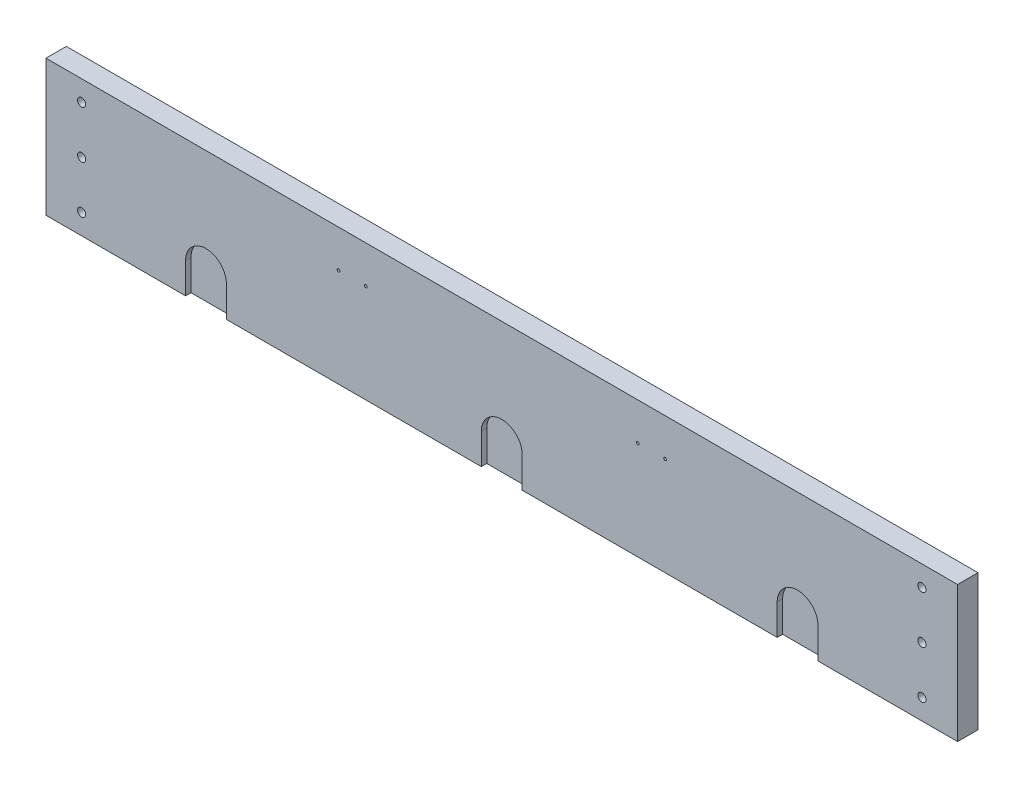
ISO-10303-21;
HEADER;
FILE_DESCRIPTION(('STEP AP214'),'2;1');
FILE_NAME('part.step','',(''),(''),'','','');
FILE_SCHEMA(('AUTOMOTIVE_DESIGN { 1 0 10303 214 1 1 1 1 }'));
ENDSEC;
DATA;
#1=APPLICATION_CONTEXT('core data for automotive mechanical design processes');
#2=APPLICATION_PROTOCOL_DEFINITION('international standard','automotive_design',2000,#1);
#3=PRODUCT_CONTEXT('',#1,'mechanical');
#4=PRODUCT('Part','Part','',(#3));
#5=PRODUCT_RELATED_PRODUCT_CATEGORY('part','',(#4));
#6=PRODUCT_DEFINITION_FORMATION('','',#4);
#7=PRODUCT_DEFINITION_CONTEXT('part definition',#1,'design');
#8=PRODUCT_DEFINITION('design','',#6,#7);
#9=PRODUCT_DEFINITION_SHAPE('','',#8);
#10=(LENGTH_UNIT() NAMED_UNIT(*) SI_UNIT(.MILLI.,.METRE.));
#11=(NAMED_UNIT(*) PLANE_ANGLE_UNIT() SI_UNIT($,.RADIAN.));
#12=(NAMED_UNIT(*) SI_UNIT($,.STERADIAN.) SOLID_ANGLE_UNIT());
#13=UNCERTAINTY_MEASURE_WITH_UNIT(LENGTH_MEASURE(1.E-05),#10,'distance_accuracy_value','');
#14=(GEOMETRIC_REPRESENTATION_CONTEXT(3) GLOBAL_UNCERTAINTY_ASSIGNED_CONTEXT((#13)) GLOBAL_UNIT_ASSIGNED_CONTEXT((#10,
#11,#12)) REPRESENTATION_CONTEXT('',''));
#15=CARTESIAN_POINT('',(0.,0.,0.));
#16=DIRECTION('',(0.,0.,1.));
#17=DIRECTION('',(1.,0.,0.));
#18=AXIS2_PLACEMENT_3D('',#15,#16,#17);
#19=CARTESIAN_POINT('',(0.,127.,0.));
#20=DIRECTION('',(0.,0.,-1.));
#21=DIRECTION('',(-1.,0.,0.));
#22=AXIS2_PLACEMENT_3D('',#19,#20,#21);
#23=PLANE('',#22);
#24=CARTESIAN_POINT('',(533.4,91.9479999999999,1.07552855510562E-13));
#25=DIRECTION('',(0.,0.,1.));
#26=DIRECTION('',(1.,0.,0.));
#27=AXIS2_PLACEMENT_3D('',#24,#25,#26);
#28=CIRCLE('',#27,1.26999999999991);
#29=CARTESIAN_POINT('',(534.67,91.9479999999999,1.07552855510562E-13));
#30=VERTEX_POINT('',#29);
#31=EDGE_CURVE('E381',#30,#30,#28,.F.);
#32=ORIENTED_EDGE('',*,*,#31,.F.);
#33=EDGE_LOOP('',(#32));
#34=FACE_BOUND('',#33,.T.);
#35=CARTESIAN_POINT('',(558.8,91.9479999999999,1.07552855510562E-13));
#36=DIRECTION('',(0.,0.,1.));
#37=DIRECTION('',(1.,0.,0.));
#38=AXIS2_PLACEMENT_3D('',#35,#36,#37);
#39=CIRCLE('',#38,1.27000000000003);
#40=CARTESIAN_POINT('',(560.07,91.9479999999999,1.07552855510562E-13));
#41=VERTEX_POINT('',#40);
#42=EDGE_CURVE('E384',#41,#41,#39,.F.);
#43=ORIENTED_EDGE('',*,*,#42,.F.);
#44=EDGE_LOOP('',(#43));
#45=FACE_BOUND('',#44,.T.);
#46=DIRECTION('',(0.,-1.,0.));
#47=VECTOR('',#46,1.);
#48=CARTESIAN_POINT('',(831.85,127.,0.));
#49=LINE('',#48,#47);
#50=CARTESIAN_POINT('',(831.85,127.,0.));
#51=VERTEX_POINT('',#50);
#52=CARTESIAN_POINT('',(831.85,0.,0.));
#53=VERTEX_POINT('',#52);
#54=EDGE_CURVE('E270',#51,#53,#49,.T.);
#55=ORIENTED_EDGE('',*,*,#54,.T.);
#56=DIRECTION('',(1.,0.,0.));
#57=VECTOR('',#56,1.);
#58=CARTESIAN_POINT('',(0.,0.,0.));
#59=LINE('',#58,#57);
#60=CARTESIAN_POINT('',(-19.05,0.,0.));
#61=VERTEX_POINT('',#60);
#62=EDGE_CURVE('E255',#61,#53,#59,.T.);
#63=ORIENTED_EDGE('',*,*,#62,.F.);
#64=DIRECTION('',(0.,-1.,0.));
#65=VECTOR('',#64,1.);
#66=CARTESIAN_POINT('',(-19.05,127.,0.));
#67=LINE('',#66,#65);
#68=CARTESIAN_POINT('',(-19.05,127.,0.));
#69=VERTEX_POINT('',#68);
#70=EDGE_CURVE('E11',#69,#61,#67,.T.);
#71=ORIENTED_EDGE('',*,*,#70,.F.);
#72=DIRECTION('',(1.,0.,0.));
#73=VECTOR('',#72,1.);
#74=CARTESIAN_POINT('',(0.,127.,0.));
#75=LINE('',#74,#73);
#76=EDGE_CURVE('E258',#69,#51,#75,.T.);
#77=ORIENTED_EDGE('',*,*,#76,.T.);
#78=EDGE_LOOP('',(#55,#63,#71,#77));
#79=FACE_BOUND('',#78,.T.);
#80=CARTESIAN_POINT('',(14.224,63.5,0.));
#81=DIRECTION('',(0.,0.,-1.));
#82=DIRECTION('',(-1.,0.,0.));
#83=AXIS2_PLACEMENT_3D('',#80,#81,#82);
#84=CIRCLE('',#83,3.80999999999999);
#85=CARTESIAN_POINT('',(10.414,63.5,0.));
#86=VERTEX_POINT('',#85);
#87=EDGE_CURVE('E228',#86,#86,#84,.F.);
#88=ORIENTED_EDGE('',*,*,#87,.T.);
#89=EDGE_LOOP('',(#88));
#90=FACE_BOUND('',#89,.T.);
#91=CARTESIAN_POINT('',(14.224,19.05,0.));
#92=DIRECTION('',(0.,0.,-1.));
#93=DIRECTION('',(-1.,0.,0.));
#94=AXIS2_PLACEMENT_3D('',#91,#92,#93);
#95=CIRCLE('',#94,3.80999999999999);
#96=CARTESIAN_POINT('',(10.414,19.05,0.));
#97=VERTEX_POINT('',#96);
#98=EDGE_CURVE('E235',#97,#97,#95,.F.);
#99=ORIENTED_EDGE('',*,*,#98,.T.);
#100=EDGE_LOOP('',(#99));
#101=FACE_BOUND('',#100,.T.);
#102=CARTESIAN_POINT('',(14.224,107.95,0.));
#103=DIRECTION('',(0.,0.,-1.));
#104=DIRECTION('',(-1.,0.,0.));
#105=AXIS2_PLACEMENT_3D('',#102,#103,#104);
#106=CIRCLE('',#105,3.80999999999999);
#107=CARTESIAN_POINT('',(10.414,107.95,0.));
#108=VERTEX_POINT('',#107);
#109=EDGE_CURVE('E231',#108,#108,#106,.F.);
#110=ORIENTED_EDGE('',*,*,#109,.T.);
#111=EDGE_LOOP('',(#110));
#112=FACE_BOUND('',#111,.T.);
#113=CARTESIAN_POINT('',(798.576,63.5,0.));
#114=DIRECTION('',(0.,0.,-1.));
#115=DIRECTION('',(-1.,0.,0.));
#116=AXIS2_PLACEMENT_3D('',#113,#114,#115);
#117=CIRCLE('',#116,3.80999999999999);
#118=CARTESIAN_POINT('',(794.766,63.5,0.));
#119=VERTEX_POINT('',#118);
#120=EDGE_CURVE('E222',#119,#119,#117,.T.);
#121=ORIENTED_EDGE('',*,*,#120,.F.);
#122=EDGE_LOOP('',(#121));
#123=FACE_BOUND('',#122,.T.);
#124=CARTESIAN_POINT('',(798.576,107.95,0.));
#125=DIRECTION('',(0.,0.,-1.));
#126=DIRECTION('',(-1.,0.,0.));
#127=AXIS2_PLACEMENT_3D('',#124,#125,#126);
#128=CIRCLE('',#127,3.80999999999999);
#129=CARTESIAN_POINT('',(794.766,107.95,0.));
#130=VERTEX_POINT('',#129);
#131=EDGE_CURVE('E247',#130,#130,#128,.T.);
#132=ORIENTED_EDGE('',*,*,#131,.F.);
#133=EDGE_LOOP('',(#132));
#134=FACE_BOUND('',#133,.T.);
#135=CARTESIAN_POINT('',(798.576,19.05,0.));
#136=DIRECTION('',(0.,0.,-1.));
#137=DIRECTION('',(-1.,0.,0.));
#138=AXIS2_PLACEMENT_3D('',#135,#136,#137);
#139=CIRCLE('',#138,3.80999999999999);
#140=CARTESIAN_POINT('',(794.766,19.05,0.));
#141=VERTEX_POINT('',#140);
#142=EDGE_CURVE('E241',#141,#141,#139,.T.);
#143=ORIENTED_EDGE('',*,*,#142,.F.);
#144=EDGE_LOOP('',(#143));
#145=FACE_BOUND('',#144,.T.);
#146=CARTESIAN_POINT('',(279.4,91.9479999999999,1.07552855510562E-13));
#147=DIRECTION('',(0.,0.,1.));
#148=DIRECTION('',(1.,0.,0.));
#149=AXIS2_PLACEMENT_3D('',#146,#147,#148);
#150=CIRCLE('',#149,1.26999999999998);
#151=CARTESIAN_POINT('',(280.67,91.9479999999999,1.07552855510562E-13));
#152=VERTEX_POINT('',#151);
#153=EDGE_CURVE('E401',#152,#152,#150,.T.);
#154=ORIENTED_EDGE('',*,*,#153,.T.);
#155=EDGE_LOOP('',(#154));
#156=FACE_BOUND('',#155,.T.);
#157=CARTESIAN_POINT('',(254.,91.9479999999999,1.07552855510562E-13));
#158=DIRECTION('',(0.,0.,1.));
#159=DIRECTION('',(1.,0.,0.));
#160=AXIS2_PLACEMENT_3D('',#157,#158,#159);
#161=CIRCLE('',#160,1.26999999999998);
#162=CARTESIAN_POINT('',(255.27,91.9479999999999,1.07552855510562E-13));
#163=VERTEX_POINT('',#162);
#164=EDGE_CURVE('E394',#163,#163,#161,.T.);
#165=ORIENTED_EDGE('',*,*,#164,.T.);
#166=EDGE_LOOP('',(#165));
#167=FACE_BOUND('',#166,.T.);
#168=ADVANCED_FACE('F40',(#34,#45,#79,#90,#101,#112,#123,#134,#145,#156,#167),#23,.T.);
#169=CARTESIAN_POINT('',(0.,127.,19.0500000000001));
#170=DIRECTION('',(0.,0.,1.));
#171=DIRECTION('',(1.,0.,0.));
#172=AXIS2_PLACEMENT_3D('',#169,#170,#171);
#173=PLANE('',#172);
#174=CARTESIAN_POINT('',(533.4,91.9479999999999,19.0500000000001));
#175=DIRECTION('',(0.,0.,1.));
#176=DIRECTION('',(1.,0.,0.));
#177=AXIS2_PLACEMENT_3D('',#174,#175,#176);
#178=CIRCLE('',#177,1.26999999999991);
#179=CARTESIAN_POINT('',(534.67,91.9479999999999,19.0500000000001));
#180=VERTEX_POINT('',#179);
#181=EDGE_CURVE('E386',#180,#180,#178,.F.);
#182=ORIENTED_EDGE('',*,*,#181,.T.);
#183=EDGE_LOOP('',(#182));
#184=FACE_BOUND('',#183,.T.);
#185=CARTESIAN_POINT('',(558.8,91.9479999999999,19.0500000000001));
#186=DIRECTION('',(0.,0.,1.));
#187=DIRECTION('',(1.,0.,0.));
#188=AXIS2_PLACEMENT_3D('',#185,#186,#187);
#189=CIRCLE('',#188,1.27000000000003);
#190=CARTESIAN_POINT('',(560.07,91.9479999999999,19.0500000000001));
#191=VERTEX_POINT('',#190);
#192=EDGE_CURVE('E387',#191,#191,#189,.F.);
#193=ORIENTED_EDGE('',*,*,#192,.T.);
#194=EDGE_LOOP('',(#193));
#195=FACE_BOUND('',#194,.T.);
#196=CARTESIAN_POINT('',(14.224,63.5,19.05));
#197=DIRECTION('',(0.,0.,-1.));
#198=DIRECTION('',(-1.,0.,0.));
#199=AXIS2_PLACEMENT_3D('',#196,#197,#198);
#200=CIRCLE('',#199,3.80999999999999);
#201=CARTESIAN_POINT('',(10.414,63.5,19.05));
#202=VERTEX_POINT('',#201);
#203=EDGE_CURVE('E232',#202,#202,#200,.F.);
#204=ORIENTED_EDGE('',*,*,#203,.F.);
#205=EDGE_LOOP('',(#204));
#206=FACE_BOUND('',#205,.T.);
#207=CARTESIAN_POINT('',(14.224,19.05,19.05));
#208=DIRECTION('',(0.,0.,-1.));
#209=DIRECTION('',(-1.,0.,0.));
#210=AXIS2_PLACEMENT_3D('',#207,#208,#209);
#211=CIRCLE('',#210,3.80999999999999);
#212=CARTESIAN_POINT('',(10.414,19.05,19.05));
#213=VERTEX_POINT('',#212);
#214=EDGE_CURVE('E238',#213,#213,#211,.F.);
#215=ORIENTED_EDGE('',*,*,#214,.F.);
#216=EDGE_LOOP('',(#215));
#217=FACE_BOUND('',#216,.T.);
#218=CARTESIAN_POINT('',(14.224,107.95,19.05));
#219=DIRECTION('',(0.,0.,-1.));
#220=DIRECTION('',(-1.,0.,0.));
#221=AXIS2_PLACEMENT_3D('',#218,#219,#220);
#222=CIRCLE('',#221,3.80999999999999);
#223=CARTESIAN_POINT('',(10.414,107.95,19.05));
#224=VERTEX_POINT('',#223);
#225=EDGE_CURVE('E252',#224,#224,#222,.F.);
#226=ORIENTED_EDGE('',*,*,#225,.F.);
#227=EDGE_LOOP('',(#226));
#228=FACE_BOUND('',#227,.T.);
#229=CARTESIAN_POINT('',(798.576,63.5,19.05));
#230=DIRECTION('',(0.,0.,-1.));
#231=DIRECTION('',(-1.,0.,0.));
#232=AXIS2_PLACEMENT_3D('',#229,#230,#231);
#233=CIRCLE('',#232,3.80999999999999);
#234=CARTESIAN_POINT('',(794.766,63.5,19.05));
#235=VERTEX_POINT('',#234);
#236=EDGE_CURVE('E185',#235,#235,#233,.T.);
#237=ORIENTED_EDGE('',*,*,#236,.T.);
#238=EDGE_LOOP('',(#237));
#239=FACE_BOUND('',#238,.T.);
#240=CARTESIAN_POINT('',(798.576,107.95,19.05));
#241=DIRECTION('',(0.,0.,-1.));
#242=DIRECTION('',(-1.,0.,0.));
#243=AXIS2_PLACEMENT_3D('',#240,#241,#242);
#244=CIRCLE('',#243,3.80999999999999);
#245=CARTESIAN_POINT('',(794.766,107.95,19.05));
#246=VERTEX_POINT('',#245);
#247=EDGE_CURVE('E225',#246,#246,#244,.T.);
#248=ORIENTED_EDGE('',*,*,#247,.T.);
#249=EDGE_LOOP('',(#248));
#250=FACE_BOUND('',#249,.T.);
#251=CARTESIAN_POINT('',(798.576,19.05,19.05));
#252=DIRECTION('',(0.,0.,-1.));
#253=DIRECTION('',(-1.,0.,0.));
#254=AXIS2_PLACEMENT_3D('',#251,#252,#253);
#255=CIRCLE('',#254,3.80999999999999);
#256=CARTESIAN_POINT('',(794.766,19.05,19.05));
#257=VERTEX_POINT('',#256);
#258=EDGE_CURVE('E244',#257,#257,#255,.T.);
#259=ORIENTED_EDGE('',*,*,#258,.T.);
#260=EDGE_LOOP('',(#259));
#261=FACE_BOUND('',#260,.T.);
#262=DIRECTION('',(-1.,0.,0.));
#263=VECTOR('',#262,1.);
#264=CARTESIAN_POINT('',(0.,0.,19.0500000000001));
#265=LINE('',#264,#263);
#266=CARTESIAN_POINT('',(663.448,0.,19.05));
#267=VERTEX_POINT('',#266);
#268=CARTESIAN_POINT('',(425.45,0.,19.05));
#269=VERTEX_POINT('',#268);
#270=EDGE_CURVE('E173',#267,#269,#265,.T.);
#271=ORIENTED_EDGE('',*,*,#270,.F.);
#272=DIRECTION('',(0.,-1.,0.));
#273=VECTOR('',#272,1.);
#274=CARTESIAN_POINT('',(663.448,0.,19.05));
#275=LINE('',#274,#273);
#276=CARTESIAN_POINT('',(663.448,28.702,19.05));
#277=VERTEX_POINT('',#276);
#278=EDGE_CURVE('E154',#277,#267,#275,.T.);
#279=ORIENTED_EDGE('',*,*,#278,.F.);
#280=CARTESIAN_POINT('',(682.498,28.702,19.05));
#281=DIRECTION('',(0.,0.,-1.));
#282=DIRECTION('',(-1.,0.,0.));
#283=AXIS2_PLACEMENT_3D('',#280,#281,#282);
#284=CIRCLE('',#283,19.05);
#285=CARTESIAN_POINT('',(701.548,28.702,19.05));
#286=VERTEX_POINT('',#285);
#287=EDGE_CURVE('E162',#277,#286,#284,.T.);
#288=ORIENTED_EDGE('',*,*,#287,.T.);
#289=DIRECTION('',(0.,-1.,0.));
#290=VECTOR('',#289,1.);
#291=CARTESIAN_POINT('',(701.548,0.,19.05));
#292=LINE('',#291,#290);
#293=CARTESIAN_POINT('',(701.548,0.,19.05));
#294=VERTEX_POINT('',#293);
#295=EDGE_CURVE('E159',#286,#294,#292,.T.);
#296=ORIENTED_EDGE('',*,*,#295,.T.);
#297=CARTESIAN_POINT('',(831.85,0.,19.05));
#298=VERTEX_POINT('',#297);
#299=EDGE_CURVE('E276',#298,#294,#265,.T.);
#300=ORIENTED_EDGE('',*,*,#299,.F.);
#301=DIRECTION('',(0.,-1.,0.));
#302=VECTOR('',#301,1.);
#303=CARTESIAN_POINT('',(831.85,127.,19.05));
#304=LINE('',#303,#302);
#305=CARTESIAN_POINT('',(831.85,127.,19.05));
#306=VERTEX_POINT('',#305);
#307=EDGE_CURVE('E283',#306,#298,#304,.T.);
#308=ORIENTED_EDGE('',*,*,#307,.F.);
#309=DIRECTION('',(-1.,0.,0.));
#310=VECTOR('',#309,1.);
#311=CARTESIAN_POINT('',(0.,127.,19.0500000000001));
#312=LINE('',#311,#310);
#313=CARTESIAN_POINT('',(-19.05,127.,19.0500000000001));
#314=VERTEX_POINT('',#313);
#315=EDGE_CURVE('E264',#306,#314,#312,.T.);
#316=ORIENTED_EDGE('',*,*,#315,.T.);
#317=DIRECTION('',(0.,-1.,0.));
#318=VECTOR('',#317,1.);
#319=CARTESIAN_POINT('',(-19.05,127.,19.0500000000001));
#320=LINE('',#319,#318);
#321=CARTESIAN_POINT('',(-19.05,0.,19.0500000000001));
#322=VERTEX_POINT('',#321);
#323=EDGE_CURVE('E47',#314,#322,#320,.T.);
#324=ORIENTED_EDGE('',*,*,#323,.T.);
#325=CARTESIAN_POINT('',(111.252,0.,19.05));
#326=VERTEX_POINT('',#325);
#327=EDGE_CURVE('E275',#326,#322,#265,.T.);
#328=ORIENTED_EDGE('',*,*,#327,.F.);
#329=DIRECTION('',(0.,-1.,0.));
#330=VECTOR('',#329,1.);
#331=CARTESIAN_POINT('',(111.252,0.,19.05));
#332=LINE('',#331,#330);
#333=CARTESIAN_POINT('',(111.252,28.702,19.05));
#334=VERTEX_POINT('',#333);
#335=EDGE_CURVE('E204',#334,#326,#332,.T.);
#336=ORIENTED_EDGE('',*,*,#335,.F.);
#337=CARTESIAN_POINT('',(130.302,28.702,19.05));
#338=DIRECTION('',(0.,0.,-1.));
#339=DIRECTION('',(-1.,0.,0.));
#340=AXIS2_PLACEMENT_3D('',#337,#338,#339);
#341=CIRCLE('',#340,19.05);
#342=CARTESIAN_POINT('',(149.352,28.702,19.05));
#343=VERTEX_POINT('',#342);
#344=EDGE_CURVE('E206',#334,#343,#341,.T.);
#345=ORIENTED_EDGE('',*,*,#344,.T.);
#346=DIRECTION('',(0.,-1.,0.));
#347=VECTOR('',#346,1.);
#348=CARTESIAN_POINT('',(149.352,0.,19.05));
#349=LINE('',#348,#347);
#350=CARTESIAN_POINT('',(149.352,0.,19.05));
#351=VERTEX_POINT('',#350);
#352=EDGE_CURVE('E209',#343,#351,#349,.T.);
#353=ORIENTED_EDGE('',*,*,#352,.T.);
#354=CARTESIAN_POINT('',(387.35,0.,19.05));
#355=VERTEX_POINT('',#354);
#356=EDGE_CURVE('E350',#355,#351,#265,.T.);
#357=ORIENTED_EDGE('',*,*,#356,.F.);
#358=DIRECTION('',(0.,-1.,0.));
#359=VECTOR('',#358,1.);
#360=CARTESIAN_POINT('',(387.35,0.,19.05));
#361=LINE('',#360,#359);
#362=CARTESIAN_POINT('',(387.35,28.702,19.05));
#363=VERTEX_POINT('',#362);
#364=EDGE_CURVE('E195',#363,#355,#361,.T.);
#365=ORIENTED_EDGE('',*,*,#364,.F.);
#366=CARTESIAN_POINT('',(406.4,28.702,19.05));
#367=DIRECTION('',(0.,0.,-1.));
#368=DIRECTION('',(-1.,0.,0.));
#369=AXIS2_PLACEMENT_3D('',#366,#367,#368);
#370=CIRCLE('',#369,19.05);
#371=CARTESIAN_POINT('',(425.45,28.702,19.05));
#372=VERTEX_POINT('',#371);
#373=EDGE_CURVE('E189',#363,#372,#370,.T.);
#374=ORIENTED_EDGE('',*,*,#373,.T.);
#375=DIRECTION('',(0.,-1.,0.));
#376=VECTOR('',#375,1.);
#377=CARTESIAN_POINT('',(425.45,0.,19.05));
#378=LINE('',#377,#376);
#379=EDGE_CURVE('E192',#372,#269,#378,.T.);
#380=ORIENTED_EDGE('',*,*,#379,.T.);
#381=EDGE_LOOP('',(#271,#279,#288,#296,#300,#308,#316,#324,#328,#336,#345,#353,#357,#365,#374,#380));
#382=FACE_BOUND('',#381,.T.);
#383=CARTESIAN_POINT('',(279.4,91.9479999999999,19.0500000000001));
#384=DIRECTION('',(0.,0.,1.));
#385=DIRECTION('',(1.,0.,0.));
#386=AXIS2_PLACEMENT_3D('',#383,#384,#385);
#387=CIRCLE('',#386,1.26999999999998);
#388=CARTESIAN_POINT('',(280.67,91.9479999999999,19.0500000000001));
#389=VERTEX_POINT('',#388);
#390=EDGE_CURVE('E406',#389,#389,#387,.T.);
#391=ORIENTED_EDGE('',*,*,#390,.F.);
#392=EDGE_LOOP('',(#391));
#393=FACE_BOUND('',#392,.T.);
#394=CARTESIAN_POINT('',(254.,91.9479999999999,19.0500000000001));
#395=DIRECTION('',(0.,0.,1.));
#396=DIRECTION('',(1.,0.,0.));
#397=AXIS2_PLACEMENT_3D('',#394,#395,#396);
#398=CIRCLE('',#397,1.26999999999998);
#399=CARTESIAN_POINT('',(255.27,91.9479999999999,19.0500000000001));
#400=VERTEX_POINT('',#399);
#401=EDGE_CURVE('E396',#400,#400,#398,.T.);
#402=ORIENTED_EDGE('',*,*,#401,.F.);
#403=EDGE_LOOP('',(#402));
#404=FACE_BOUND('',#403,.T.);
#405=ADVANCED_FACE('F169',(#184,#195,#206,#217,#228,#239,#250,#261,#382,#393,#404),#173,.T.);
#406=CARTESIAN_POINT('',(663.448,0.,19.05));
#407=DIRECTION('',(1.,0.,0.));
#408=DIRECTION('',(0.,0.,-1.));
#409=AXIS2_PLACEMENT_3D('',#406,#407,#408);
#410=PLANE('',#409);
#411=DIRECTION('',(0.,0.,-1.));
#412=VECTOR('',#411,1.);
#413=CARTESIAN_POINT('',(663.448,0.,19.05));
#414=LINE('',#413,#412);
#415=CARTESIAN_POINT('',(663.448,0.,13.97));
#416=VERTEX_POINT('',#415);
#417=EDGE_CURVE('E54',#267,#416,#414,.T.);
#418=ORIENTED_EDGE('',*,*,#417,.T.);
#419=DIRECTION('',(0.,-1.,0.));
#420=VECTOR('',#419,1.);
#421=CARTESIAN_POINT('',(663.448,0.,13.97));
#422=LINE('',#421,#420);
#423=CARTESIAN_POINT('',(663.448,28.702,13.97));
#424=VERTEX_POINT('',#423);
#425=EDGE_CURVE('E155',#424,#416,#422,.T.);
#426=ORIENTED_EDGE('',*,*,#425,.F.);
#427=DIRECTION('',(0.,0.,-1.));
#428=VECTOR('',#427,1.);
#429=CARTESIAN_POINT('',(663.448,28.702,19.05));
#430=LINE('',#429,#428);
#431=EDGE_CURVE('E150',#277,#424,#430,.T.);
#432=ORIENTED_EDGE('',*,*,#431,.F.);
#433=ORIENTED_EDGE('',*,*,#278,.T.);
#434=EDGE_LOOP('',(#418,#426,#432,#433));
#435=FACE_BOUND('',#434,.T.);
#436=ADVANCED_FACE('F152',(#435),#410,.T.);
#437=CARTESIAN_POINT('',(701.548,0.,19.05));
#438=DIRECTION('',(1.,0.,0.));
#439=DIRECTION('',(0.,0.,-1.));
#440=AXIS2_PLACEMENT_3D('',#437,#438,#439);
#441=PLANE('',#440);
#442=DIRECTION('',(0.,1.,0.));
#443=VECTOR('',#442,1.);
#444=CARTESIAN_POINT('',(701.548,0.,13.97));
#445=LINE('',#444,#443);
#446=CARTESIAN_POINT('',(701.548,0.,13.97));
#447=VERTEX_POINT('',#446);
#448=CARTESIAN_POINT('',(701.548,28.702,13.97));
#449=VERTEX_POINT('',#448);
#450=EDGE_CURVE('E62',#447,#449,#445,.T.);
#451=ORIENTED_EDGE('',*,*,#450,.F.);
#452=DIRECTION('',(0.,0.,-1.));
#453=VECTOR('',#452,1.);
#454=CARTESIAN_POINT('',(701.548,0.,19.05));
#455=LINE('',#454,#453);
#456=EDGE_CURVE('E186',#294,#447,#455,.T.);
#457=ORIENTED_EDGE('',*,*,#456,.F.);
#458=ORIENTED_EDGE('',*,*,#295,.F.);
#459=DIRECTION('',(0.,0.,-1.));
#460=VECTOR('',#459,1.);
#461=CARTESIAN_POINT('',(701.548,28.702,19.05));
#462=LINE('',#461,#460);
#463=EDGE_CURVE('E158',#286,#449,#462,.T.);
#464=ORIENTED_EDGE('',*,*,#463,.T.);
#465=EDGE_LOOP('',(#451,#457,#458,#464));
#466=FACE_BOUND('',#465,.T.);
#467=ADVANCED_FACE('F307',(#466),#441,.F.);
#468=CARTESIAN_POINT('',(682.498,28.702,19.05));
#469=DIRECTION('',(0.,0.,-1.));
#470=DIRECTION('',(-1.,0.,0.));
#471=AXIS2_PLACEMENT_3D('',#468,#469,#470);
#472=CYLINDRICAL_SURFACE('',#471,19.05);
#473=CARTESIAN_POINT('',(682.498,28.702,13.97));
#474=DIRECTION('',(0.,0.,-1.));
#475=DIRECTION('',(-1.,0.,0.));
#476=AXIS2_PLACEMENT_3D('',#473,#474,#475);
#477=CIRCLE('',#476,19.05);
#478=EDGE_CURVE('E310',#449,#424,#477,.F.);
#479=ORIENTED_EDGE('',*,*,#478,.F.);
#480=ORIENTED_EDGE('',*,*,#463,.F.);
#481=ORIENTED_EDGE('',*,*,#287,.F.);
#482=ORIENTED_EDGE('',*,*,#431,.T.);
#483=EDGE_LOOP('',(#479,#480,#481,#482));
#484=FACE_BOUND('',#483,.T.);
#485=ADVANCED_FACE('F163',(#484),#472,.F.);
#486=CARTESIAN_POINT('',(111.252,0.,19.05));
#487=DIRECTION('',(1.,0.,0.));
#488=DIRECTION('',(0.,0.,-1.));
#489=AXIS2_PLACEMENT_3D('',#486,#487,#488);
#490=PLANE('',#489);
#491=DIRECTION('',(0.,0.,-1.));
#492=VECTOR('',#491,1.);
#493=CARTESIAN_POINT('',(111.252,0.,19.05));
#494=LINE('',#493,#492);
#495=CARTESIAN_POINT('',(111.252,0.,13.97));
#496=VERTEX_POINT('',#495);
#497=EDGE_CURVE('E193',#326,#496,#494,.T.);
#498=ORIENTED_EDGE('',*,*,#497,.T.);
#499=DIRECTION('',(0.,-1.,0.));
#500=VECTOR('',#499,1.);
#501=CARTESIAN_POINT('',(111.252,0.,13.97));
#502=LINE('',#501,#500);
#503=CARTESIAN_POINT('',(111.252,28.702,13.97));
#504=VERTEX_POINT('',#503);
#505=EDGE_CURVE('E313',#504,#496,#502,.T.);
#506=ORIENTED_EDGE('',*,*,#505,.F.);
#507=DIRECTION('',(0.,0.,-1.));
#508=VECTOR('',#507,1.);
#509=CARTESIAN_POINT('',(111.252,28.702,19.05));
#510=LINE('',#509,#508);
#511=EDGE_CURVE('E212',#334,#504,#510,.T.);
#512=ORIENTED_EDGE('',*,*,#511,.F.);
#513=ORIENTED_EDGE('',*,*,#335,.T.);
#514=EDGE_LOOP('',(#498,#506,#512,#513));
#515=FACE_BOUND('',#514,.T.);
#516=ADVANCED_FACE('F357',(#515),#490,.T.);
#517=CARTESIAN_POINT('',(149.352,0.,19.05));
#518=DIRECTION('',(1.,0.,0.));
#519=DIRECTION('',(0.,0.,-1.));
#520=AXIS2_PLACEMENT_3D('',#517,#518,#519);
#521=PLANE('',#520);
#522=DIRECTION('',(0.,1.,0.));
#523=VECTOR('',#522,1.);
#524=CARTESIAN_POINT('',(149.352,0.,13.97));
#525=LINE('',#524,#523);
#526=CARTESIAN_POINT('',(149.352,0.,13.97));
#527=VERTEX_POINT('',#526);
#528=CARTESIAN_POINT('',(149.352,28.702,13.97));
#529=VERTEX_POINT('',#528);
#530=EDGE_CURVE('E323',#527,#529,#525,.T.);
#531=ORIENTED_EDGE('',*,*,#530,.F.);
#532=DIRECTION('',(0.,0.,-1.));
#533=VECTOR('',#532,1.);
#534=CARTESIAN_POINT('',(149.352,0.,19.05));
#535=LINE('',#534,#533);
#536=EDGE_CURVE('E214',#351,#527,#535,.T.);
#537=ORIENTED_EDGE('',*,*,#536,.F.);
#538=ORIENTED_EDGE('',*,*,#352,.F.);
#539=DIRECTION('',(0.,0.,-1.));
#540=VECTOR('',#539,1.);
#541=CARTESIAN_POINT('',(149.352,28.702,19.05));
#542=LINE('',#541,#540);
#543=EDGE_CURVE('E217',#343,#529,#542,.T.);
#544=ORIENTED_EDGE('',*,*,#543,.T.);
#545=EDGE_LOOP('',(#531,#537,#538,#544));
#546=FACE_BOUND('',#545,.T.);
#547=ADVANCED_FACE('F361',(#546),#521,.F.);
#548=CARTESIAN_POINT('',(130.302,28.702,19.05));
#549=DIRECTION('',(0.,0.,-1.));
#550=DIRECTION('',(-1.,0.,0.));
#551=AXIS2_PLACEMENT_3D('',#548,#549,#550);
#552=CYLINDRICAL_SURFACE('',#551,19.05);
#553=CARTESIAN_POINT('',(130.302,28.702,13.97));
#554=DIRECTION('',(0.,0.,-1.));
#555=DIRECTION('',(-1.,0.,0.));
#556=AXIS2_PLACEMENT_3D('',#553,#554,#555);
#557=CIRCLE('',#556,19.05);
#558=EDGE_CURVE('E320',#529,#504,#557,.F.);
#559=ORIENTED_EDGE('',*,*,#558,.F.);
#560=ORIENTED_EDGE('',*,*,#543,.F.);
#561=ORIENTED_EDGE('',*,*,#344,.F.);
#562=ORIENTED_EDGE('',*,*,#511,.T.);
#563=EDGE_LOOP('',(#559,#560,#561,#562));
#564=FACE_BOUND('',#563,.T.);
#565=ADVANCED_FACE('F360',(#564),#552,.F.);
#566=CARTESIAN_POINT('',(406.4,28.702,19.05));
#567=DIRECTION('',(0.,0.,-1.));
#568=DIRECTION('',(-1.,0.,0.));
#569=AXIS2_PLACEMENT_3D('',#566,#567,#568);
#570=CYLINDRICAL_SURFACE('',#569,19.05);
#571=CARTESIAN_POINT('',(406.4,28.702,13.97));
#572=DIRECTION('',(0.,0.,-1.));
#573=DIRECTION('',(-1.,0.,0.));
#574=AXIS2_PLACEMENT_3D('',#571,#572,#573);
#575=CIRCLE('',#574,19.05);
#576=CARTESIAN_POINT('',(425.45,28.702,13.97));
#577=VERTEX_POINT('',#576);
#578=CARTESIAN_POINT('',(387.35,28.702,13.97));
#579=VERTEX_POINT('',#578);
#580=EDGE_CURVE('E332',#577,#579,#575,.F.);
#581=ORIENTED_EDGE('',*,*,#580,.F.);
#582=DIRECTION('',(0.,0.,-1.));
#583=VECTOR('',#582,1.);
#584=CARTESIAN_POINT('',(425.45,28.702,19.05));
#585=LINE('',#584,#583);
#586=EDGE_CURVE('E196',#372,#577,#585,.T.);
#587=ORIENTED_EDGE('',*,*,#586,.F.);
#588=ORIENTED_EDGE('',*,*,#373,.F.);
#589=DIRECTION('',(0.,0.,-1.));
#590=VECTOR('',#589,1.);
#591=CARTESIAN_POINT('',(387.35,28.702,19.05));
#592=LINE('',#591,#590);
#593=EDGE_CURVE('E174',#363,#579,#592,.T.);
#594=ORIENTED_EDGE('',*,*,#593,.T.);
#595=EDGE_LOOP('',(#581,#587,#588,#594));
#596=FACE_BOUND('',#595,.T.);
#597=ADVANCED_FACE('F347',(#596),#570,.F.);
#598=CARTESIAN_POINT('',(387.35,0.,19.05));
#599=DIRECTION('',(1.,0.,0.));
#600=DIRECTION('',(0.,0.,-1.));
#601=AXIS2_PLACEMENT_3D('',#598,#599,#600);
#602=PLANE('',#601);
#603=DIRECTION('',(0.,0.,-1.));
#604=VECTOR('',#603,1.);
#605=CARTESIAN_POINT('',(387.35,0.,19.05));
#606=LINE('',#605,#604);
#607=CARTESIAN_POINT('',(387.35,0.,13.97));
#608=VERTEX_POINT('',#607);
#609=EDGE_CURVE('E177',#355,#608,#606,.T.);
#610=ORIENTED_EDGE('',*,*,#609,.T.);
#611=DIRECTION('',(0.,-1.,0.));
#612=VECTOR('',#611,1.);
#613=CARTESIAN_POINT('',(387.35,0.,13.97));
#614=LINE('',#613,#612);
#615=EDGE_CURVE('E329',#579,#608,#614,.T.);
#616=ORIENTED_EDGE('',*,*,#615,.F.);
#617=ORIENTED_EDGE('',*,*,#593,.F.);
#618=ORIENTED_EDGE('',*,*,#364,.T.);
#619=EDGE_LOOP('',(#610,#616,#617,#618));
#620=FACE_BOUND('',#619,.T.);
#621=ADVANCED_FACE('F344',(#620),#602,.T.);
#622=CARTESIAN_POINT('',(425.45,0.,19.05));
#623=DIRECTION('',(1.,0.,0.));
#624=DIRECTION('',(0.,0.,-1.));
#625=AXIS2_PLACEMENT_3D('',#622,#623,#624);
#626=PLANE('',#625);
#627=DIRECTION('',(0.,1.,0.));
#628=VECTOR('',#627,1.);
#629=CARTESIAN_POINT('',(425.45,0.,13.97));
#630=LINE('',#629,#628);
#631=CARTESIAN_POINT('',(425.45,0.,13.97));
#632=VERTEX_POINT('',#631);
#633=EDGE_CURVE('E334',#632,#577,#630,.T.);
#634=ORIENTED_EDGE('',*,*,#633,.F.);
#635=DIRECTION('',(0.,0.,-1.));
#636=VECTOR('',#635,1.);
#637=CARTESIAN_POINT('',(425.45,0.,19.05));
#638=LINE('',#637,#636);
#639=EDGE_CURVE('E199',#269,#632,#638,.T.);
#640=ORIENTED_EDGE('',*,*,#639,.F.);
#641=ORIENTED_EDGE('',*,*,#379,.F.);
#642=ORIENTED_EDGE('',*,*,#586,.T.);
#643=EDGE_LOOP('',(#634,#640,#641,#642));
#644=FACE_BOUND('',#643,.T.);
#645=ADVANCED_FACE('F473',(#644),#626,.F.);
#646=CARTESIAN_POINT('',(-19.05,127.,0.));
#647=DIRECTION('',(1.,0.,0.));
#648=DIRECTION('',(0.,0.,-1.));
#649=AXIS2_PLACEMENT_3D('',#646,#647,#648);
#650=PLANE('',#649);
#651=DIRECTION('',(0.,0.,1.));
#652=VECTOR('',#651,1.);
#653=CARTESIAN_POINT('',(-19.05,0.,0.));
#654=LINE('',#653,#652);
#655=EDGE_CURVE('E272',#61,#322,#654,.T.);
#656=ORIENTED_EDGE('',*,*,#655,.T.);
#657=ORIENTED_EDGE('',*,*,#323,.F.);
#658=DIRECTION('',(0.,0.,1.));
#659=VECTOR('',#658,1.);
#660=CARTESIAN_POINT('',(-19.05,127.,0.));
#661=LINE('',#660,#659);
#662=EDGE_CURVE('E261',#69,#314,#661,.T.);
#663=ORIENTED_EDGE('',*,*,#662,.F.);
#664=ORIENTED_EDGE('',*,*,#70,.T.);
#665=EDGE_LOOP('',(#656,#657,#663,#664));
#666=FACE_BOUND('',#665,.T.);
#667=ADVANCED_FACE('F292',(#666),#650,.F.);
#668=CARTESIAN_POINT('',(831.85,127.,0.));
#669=DIRECTION('',(1.,0.,0.));
#670=DIRECTION('',(0.,0.,-1.));
#671=AXIS2_PLACEMENT_3D('',#668,#669,#670);
#672=PLANE('',#671);
#673=DIRECTION('',(0.,0.,1.));
#674=VECTOR('',#673,1.);
#675=CARTESIAN_POINT('',(831.85,0.,0.));
#676=LINE('',#675,#674);
#677=EDGE_CURVE('E262',#53,#298,#676,.T.);
#678=ORIENTED_EDGE('',*,*,#677,.F.);
#679=ORIENTED_EDGE('',*,*,#54,.F.);
#680=DIRECTION('',(0.,0.,1.));
#681=VECTOR('',#680,1.);
#682=CARTESIAN_POINT('',(831.85,127.,0.));
#683=LINE('',#682,#681);
#684=EDGE_CURVE('E267',#51,#306,#683,.T.);
#685=ORIENTED_EDGE('',*,*,#684,.T.);
#686=ORIENTED_EDGE('',*,*,#307,.T.);
#687=EDGE_LOOP('',(#678,#679,#685,#686));
#688=FACE_BOUND('',#687,.T.);
#689=ADVANCED_FACE('F303',(#688),#672,.T.);
#690=CARTESIAN_POINT('',(0.,127.,0.));
#691=DIRECTION('',(0.,1.,0.));
#692=DIRECTION('',(0.,0.,1.));
#693=AXIS2_PLACEMENT_3D('',#690,#691,#692);
#694=PLANE('',#693);
#695=ORIENTED_EDGE('',*,*,#76,.F.);
#696=ORIENTED_EDGE('',*,*,#662,.T.);
#697=ORIENTED_EDGE('',*,*,#315,.F.);
#698=ORIENTED_EDGE('',*,*,#684,.F.);
#699=EDGE_LOOP('',(#695,#696,#697,#698));
#700=FACE_BOUND('',#699,.T.);
#701=ADVANCED_FACE('F501',(#700),#694,.T.);
#702=CARTESIAN_POINT('',(0.,0.,0.));
#703=DIRECTION('',(0.,1.,0.));
#704=DIRECTION('',(0.,0.,1.));
#705=AXIS2_PLACEMENT_3D('',#702,#703,#704);
#706=PLANE('',#705);
#707=ORIENTED_EDGE('',*,*,#299,.T.);
#708=ORIENTED_EDGE('',*,*,#456,.T.);
#709=DIRECTION('',(-1.,0.,0.));
#710=VECTOR('',#709,1.);
#711=CARTESIAN_POINT('',(0.,0.,13.97));
#712=LINE('',#711,#710);
#713=EDGE_CURVE('E311',#447,#416,#712,.T.);
#714=ORIENTED_EDGE('',*,*,#713,.T.);
#715=ORIENTED_EDGE('',*,*,#417,.F.);
#716=ORIENTED_EDGE('',*,*,#270,.T.);
#717=ORIENTED_EDGE('',*,*,#639,.T.);
#718=DIRECTION('',(-1.,0.,0.));
#719=VECTOR('',#718,1.);
#720=CARTESIAN_POINT('',(0.,0.,13.97));
#721=LINE('',#720,#719);
#722=EDGE_CURVE('E180',#632,#608,#721,.T.);
#723=ORIENTED_EDGE('',*,*,#722,.T.);
#724=ORIENTED_EDGE('',*,*,#609,.F.);
#725=ORIENTED_EDGE('',*,*,#356,.T.);
#726=ORIENTED_EDGE('',*,*,#536,.T.);
#727=DIRECTION('',(-1.,0.,0.));
#728=VECTOR('',#727,1.);
#729=CARTESIAN_POINT('',(0.,0.,13.97));
#730=LINE('',#729,#728);
#731=EDGE_CURVE('E326',#527,#496,#730,.T.);
#732=ORIENTED_EDGE('',*,*,#731,.T.);
#733=ORIENTED_EDGE('',*,*,#497,.F.);
#734=ORIENTED_EDGE('',*,*,#327,.T.);
#735=ORIENTED_EDGE('',*,*,#655,.F.);
#736=ORIENTED_EDGE('',*,*,#62,.T.);
#737=ORIENTED_EDGE('',*,*,#677,.T.);
#738=EDGE_LOOP('',(#707,#708,#714,#715,#716,#717,#723,#724,#725,#726,#732,#733,#734,#735,#736,#737));
#739=FACE_BOUND('',#738,.T.);
#740=ADVANCED_FACE('F295',(#739),#706,.F.);
#741=CARTESIAN_POINT('',(14.224,107.95,19.05));
#742=DIRECTION('',(0.,0.,-1.));
#743=DIRECTION('',(-1.,0.,0.));
#744=AXIS2_PLACEMENT_3D('',#741,#742,#743);
#745=CYLINDRICAL_SURFACE('',#744,3.80999999999999);
#746=ORIENTED_EDGE('',*,*,#225,.T.);
#747=EDGE_LOOP('',(#746));
#748=FACE_BOUND('',#747,.T.);
#749=ORIENTED_EDGE('',*,*,#109,.F.);
#750=EDGE_LOOP('',(#749));
#751=FACE_BOUND('',#750,.T.);
#752=ADVANCED_FACE('F515',(#748,#751),#745,.F.);
#753=CARTESIAN_POINT('',(798.576,63.5,19.05));
#754=DIRECTION('',(0.,0.,-1.));
#755=DIRECTION('',(-1.,0.,0.));
#756=AXIS2_PLACEMENT_3D('',#753,#754,#755);
#757=CYLINDRICAL_SURFACE('',#756,3.80999999999999);
#758=ORIENTED_EDGE('',*,*,#236,.F.);
#759=EDGE_LOOP('',(#758));
#760=FACE_BOUND('',#759,.T.);
#761=ORIENTED_EDGE('',*,*,#120,.T.);
#762=EDGE_LOOP('',(#761));
#763=FACE_BOUND('',#762,.T.);
#764=ADVANCED_FACE('F522',(#760,#763),#757,.F.);
#765=CARTESIAN_POINT('',(798.576,107.95,19.05));
#766=DIRECTION('',(0.,0.,-1.));
#767=DIRECTION('',(-1.,0.,0.));
#768=AXIS2_PLACEMENT_3D('',#765,#766,#767);
#769=CYLINDRICAL_SURFACE('',#768,3.80999999999999);
#770=ORIENTED_EDGE('',*,*,#247,.F.);
#771=EDGE_LOOP('',(#770));
#772=FACE_BOUND('',#771,.T.);
#773=ORIENTED_EDGE('',*,*,#131,.T.);
#774=EDGE_LOOP('',(#773));
#775=FACE_BOUND('',#774,.T.);
#776=ADVANCED_FACE('F435',(#772,#775),#769,.F.);
#777=CARTESIAN_POINT('',(798.576,19.05,19.05));
#778=DIRECTION('',(0.,0.,-1.));
#779=DIRECTION('',(-1.,0.,0.));
#780=AXIS2_PLACEMENT_3D('',#777,#778,#779);
#781=CYLINDRICAL_SURFACE('',#780,3.80999999999999);
#782=ORIENTED_EDGE('',*,*,#258,.F.);
#783=EDGE_LOOP('',(#782));
#784=FACE_BOUND('',#783,.T.);
#785=ORIENTED_EDGE('',*,*,#142,.T.);
#786=EDGE_LOOP('',(#785));
#787=FACE_BOUND('',#786,.T.);
#788=ADVANCED_FACE('F431',(#784,#787),#781,.F.);
#789=CARTESIAN_POINT('',(14.224,19.05,19.05));
#790=DIRECTION('',(0.,0.,-1.));
#791=DIRECTION('',(-1.,0.,0.));
#792=AXIS2_PLACEMENT_3D('',#789,#790,#791);
#793=CYLINDRICAL_SURFACE('',#792,3.80999999999999);
#794=ORIENTED_EDGE('',*,*,#214,.T.);
#795=EDGE_LOOP('',(#794));
#796=FACE_BOUND('',#795,.T.);
#797=ORIENTED_EDGE('',*,*,#98,.F.);
#798=EDGE_LOOP('',(#797));
#799=FACE_BOUND('',#798,.T.);
#800=ADVANCED_FACE('F434',(#796,#799),#793,.F.);
#801=CARTESIAN_POINT('',(14.224,63.5,19.05));
#802=DIRECTION('',(0.,0.,-1.));
#803=DIRECTION('',(-1.,0.,0.));
#804=AXIS2_PLACEMENT_3D('',#801,#802,#803);
#805=CYLINDRICAL_SURFACE('',#804,3.80999999999999);
#806=ORIENTED_EDGE('',*,*,#203,.T.);
#807=EDGE_LOOP('',(#806));
#808=FACE_BOUND('',#807,.T.);
#809=ORIENTED_EDGE('',*,*,#87,.F.);
#810=EDGE_LOOP('',(#809));
#811=FACE_BOUND('',#810,.T.);
#812=ADVANCED_FACE('F464',(#808,#811),#805,.F.);
#813=CARTESIAN_POINT('',(0.,0.,13.97));
#814=DIRECTION('',(0.,0.,-1.));
#815=DIRECTION('',(-1.,0.,0.));
#816=AXIS2_PLACEMENT_3D('',#813,#814,#815);
#817=PLANE('',#816);
#818=ORIENTED_EDGE('',*,*,#615,.T.);
#819=ORIENTED_EDGE('',*,*,#722,.F.);
#820=ORIENTED_EDGE('',*,*,#633,.T.);
#821=ORIENTED_EDGE('',*,*,#580,.T.);
#822=EDGE_LOOP('',(#818,#819,#820,#821));
#823=FACE_BOUND('',#822,.T.);
#824=ADVANCED_FACE('F342',(#823),#817,.F.);
#825=CARTESIAN_POINT('',(0.,0.,13.97));
#826=DIRECTION('',(0.,0.,-1.));
#827=DIRECTION('',(-1.,0.,0.));
#828=AXIS2_PLACEMENT_3D('',#825,#826,#827);
#829=PLANE('',#828);
#830=ORIENTED_EDGE('',*,*,#505,.T.);
#831=ORIENTED_EDGE('',*,*,#731,.F.);
#832=ORIENTED_EDGE('',*,*,#530,.T.);
#833=ORIENTED_EDGE('',*,*,#558,.T.);
#834=EDGE_LOOP('',(#830,#831,#832,#833));
#835=FACE_BOUND('',#834,.T.);
#836=ADVANCED_FACE('F355',(#835),#829,.F.);
#837=CARTESIAN_POINT('',(0.,0.,13.97));
#838=DIRECTION('',(0.,0.,-1.));
#839=DIRECTION('',(-1.,0.,0.));
#840=AXIS2_PLACEMENT_3D('',#837,#838,#839);
#841=PLANE('',#840);
#842=ORIENTED_EDGE('',*,*,#425,.T.);
#843=ORIENTED_EDGE('',*,*,#713,.F.);
#844=ORIENTED_EDGE('',*,*,#450,.T.);
#845=ORIENTED_EDGE('',*,*,#478,.T.);
#846=EDGE_LOOP('',(#842,#843,#844,#845));
#847=FACE_BOUND('',#846,.T.);
#848=ADVANCED_FACE('F309',(#847),#841,.F.);
#849=CARTESIAN_POINT('',(558.8,91.9479999999999,1.07552855510562E-13));
#850=DIRECTION('',(0.,0.,1.));
#851=DIRECTION('',(1.,0.,0.));
#852=AXIS2_PLACEMENT_3D('',#849,#850,#851);
#853=CYLINDRICAL_SURFACE('',#852,1.27000000000003);
#854=ORIENTED_EDGE('',*,*,#42,.T.);
#855=EDGE_LOOP('',(#854));
#856=FACE_BOUND('',#855,.T.);
#857=ORIENTED_EDGE('',*,*,#192,.F.);
#858=EDGE_LOOP('',(#857));
#859=FACE_BOUND('',#858,.T.);
#860=ADVANCED_FACE('F413',(#856,#859),#853,.F.);
#861=CARTESIAN_POINT('',(533.4,91.9479999999999,1.07552855510562E-13));
#862=DIRECTION('',(0.,0.,1.));
#863=DIRECTION('',(1.,0.,0.));
#864=AXIS2_PLACEMENT_3D('',#861,#862,#863);
#865=CYLINDRICAL_SURFACE('',#864,1.26999999999991);
#866=ORIENTED_EDGE('',*,*,#31,.T.);
#867=EDGE_LOOP('',(#866));
#868=FACE_BOUND('',#867,.T.);
#869=ORIENTED_EDGE('',*,*,#181,.F.);
#870=EDGE_LOOP('',(#869));
#871=FACE_BOUND('',#870,.T.);
#872=ADVANCED_FACE('F409',(#868,#871),#865,.F.);
#873=CARTESIAN_POINT('',(279.4,91.9479999999999,1.07552855510562E-13));
#874=DIRECTION('',(0.,0.,1.));
#875=DIRECTION('',(1.,0.,0.));
#876=AXIS2_PLACEMENT_3D('',#873,#874,#875);
#877=CYLINDRICAL_SURFACE('',#876,1.26999999999998);
#878=ORIENTED_EDGE('',*,*,#153,.F.);
#879=EDGE_LOOP('',(#878));
#880=FACE_BOUND('',#879,.T.);
#881=ORIENTED_EDGE('',*,*,#390,.T.);
#882=EDGE_LOOP('',(#881));
#883=FACE_BOUND('',#882,.T.);
#884=ADVANCED_FACE('F412',(#880,#883),#877,.F.);
#885=CARTESIAN_POINT('',(254.,91.9479999999999,1.07552855510562E-13));
#886=DIRECTION('',(0.,0.,1.));
#887=DIRECTION('',(1.,0.,0.));
#888=AXIS2_PLACEMENT_3D('',#885,#886,#887);
#889=CYLINDRICAL_SURFACE('',#888,1.26999999999998);
#890=ORIENTED_EDGE('',*,*,#164,.F.);
#891=EDGE_LOOP('',(#890));
#892=FACE_BOUND('',#891,.T.);
#893=ORIENTED_EDGE('',*,*,#401,.T.);
#894=EDGE_LOOP('',(#893));
#895=FACE_BOUND('',#894,.T.);
#896=ADVANCED_FACE('F444',(#892,#895),#889,.F.);
#897=CLOSED_SHELL('',(#168,#405,#436,#467,#485,#516,#547,#565,#597,#621,#645,#667,#689,#701,
#740,#752,#764,#776,#788,#800,#812,#824,#836,#848,#860,#872,#884,#896));
#898=MANIFOLD_SOLID_BREP('B2',#897);
#899=ADVANCED_BREP_SHAPE_REPRESENTATION('',(#18,#898),#14);
#900=SHAPE_DEFINITION_REPRESENTATION(#9,#899);
ENDSEC;
END-ISO-10303-21;
